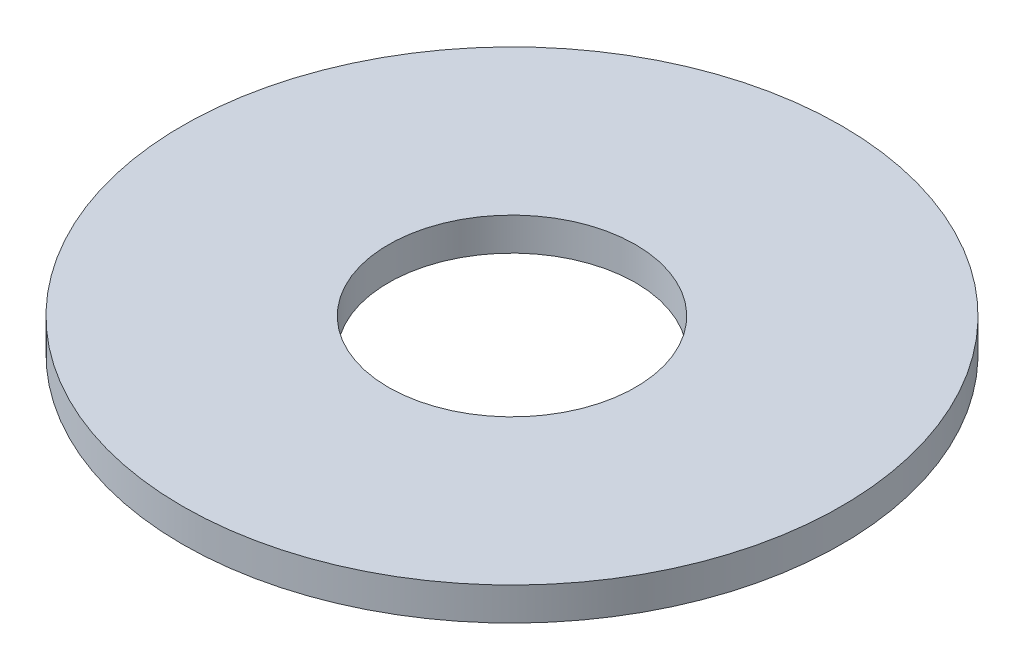
ISO-10303-21;
HEADER;
FILE_DESCRIPTION(('STEP AP214'),'2;1');
FILE_NAME('part.step','',(''),(''),'','','');
FILE_SCHEMA(('AUTOMOTIVE_DESIGN { 1 0 10303 214 1 1 1 1 }'));
ENDSEC;
DATA;
#1=APPLICATION_CONTEXT('core data for automotive mechanical design processes');
#2=APPLICATION_PROTOCOL_DEFINITION('international standard','automotive_design',2000,#1);
#3=PRODUCT_CONTEXT('',#1,'mechanical');
#4=PRODUCT('Part','Part','',(#3));
#5=PRODUCT_RELATED_PRODUCT_CATEGORY('part','',(#4));
#6=PRODUCT_DEFINITION_FORMATION('','',#4);
#7=PRODUCT_DEFINITION_CONTEXT('part definition',#1,'design');
#8=PRODUCT_DEFINITION('design','',#6,#7);
#9=PRODUCT_DEFINITION_SHAPE('','',#8);
#10=(LENGTH_UNIT() NAMED_UNIT(*) SI_UNIT(.MILLI.,.METRE.));
#11=(NAMED_UNIT(*) PLANE_ANGLE_UNIT() SI_UNIT($,.RADIAN.));
#12=(NAMED_UNIT(*) SI_UNIT($,.STERADIAN.) SOLID_ANGLE_UNIT());
#13=UNCERTAINTY_MEASURE_WITH_UNIT(LENGTH_MEASURE(1.E-05),#10,'distance_accuracy_value','');
#14=(GEOMETRIC_REPRESENTATION_CONTEXT(3) GLOBAL_UNCERTAINTY_ASSIGNED_CONTEXT((#13)) GLOBAL_UNIT_ASSIGNED_CONTEXT((#10,
#11,#12)) REPRESENTATION_CONTEXT('',''));
#15=CARTESIAN_POINT('',(0.,0.,0.));
#16=DIRECTION('',(0.,0.,1.));
#17=DIRECTION('',(1.,0.,0.));
#18=AXIS2_PLACEMENT_3D('',#15,#16,#17);
#19=CARTESIAN_POINT('',(0.,4.,0.));
#20=DIRECTION('',(0.,-1.,0.));
#21=DIRECTION('',(0.,0.,-1.));
#22=AXIS2_PLACEMENT_3D('',#19,#20,#21);
#23=CYLINDRICAL_SURFACE('',#22,40.);
#24=CARTESIAN_POINT('',(0.,4.,0.));
#25=DIRECTION('',(0.,1.,0.));
#26=DIRECTION('',(0.,0.,1.));
#27=AXIS2_PLACEMENT_3D('',#24,#25,#26);
#28=CIRCLE('',#27,40.);
#29=CARTESIAN_POINT('',(0.,4.,40.));
#30=VERTEX_POINT('',#29);
#31=EDGE_CURVE('E10',#30,#30,#28,.T.);
#32=ORIENTED_EDGE('',*,*,#31,.F.);
#33=EDGE_LOOP('',(#32));
#34=FACE_BOUND('',#33,.T.);
#35=CARTESIAN_POINT('',(0.,0.,0.));
#36=DIRECTION('',(0.,1.,0.));
#37=DIRECTION('',(0.,0.,1.));
#38=AXIS2_PLACEMENT_3D('',#35,#36,#37);
#39=CIRCLE('',#38,40.);
#40=CARTESIAN_POINT('',(0.,0.,40.));
#41=VERTEX_POINT('',#40);
#42=EDGE_CURVE('E37',#41,#41,#39,.T.);
#43=ORIENTED_EDGE('',*,*,#42,.T.);
#44=EDGE_LOOP('',(#43));
#45=FACE_BOUND('',#44,.T.);
#46=ADVANCED_FACE('F40',(#34,#45),#23,.T.);
#47=CARTESIAN_POINT('',(0.,4.,0.));
#48=DIRECTION('',(0.,1.,0.));
#49=DIRECTION('',(0.,0.,1.));
#50=AXIS2_PLACEMENT_3D('',#47,#48,#49);
#51=PLANE('',#50);
#52=CARTESIAN_POINT('',(0.,4.,0.));
#53=DIRECTION('',(0.,1.,0.));
#54=DIRECTION('',(0.,0.,1.));
#55=AXIS2_PLACEMENT_3D('',#52,#53,#54);
#56=CIRCLE('',#55,15.);
#57=CARTESIAN_POINT('',(0.,4.,15.));
#58=VERTEX_POINT('',#57);
#59=EDGE_CURVE('E50',#58,#58,#56,.T.);
#60=ORIENTED_EDGE('',*,*,#59,.F.);
#61=EDGE_LOOP('',(#60));
#62=FACE_BOUND('',#61,.T.);
#63=ORIENTED_EDGE('',*,*,#31,.T.);
#64=EDGE_LOOP('',(#63));
#65=FACE_BOUND('',#64,.T.);
#66=ADVANCED_FACE('F59',(#62,#65),#51,.T.);
#67=CARTESIAN_POINT('',(0.,0.,0.));
#68=DIRECTION('',(0.,1.,0.));
#69=DIRECTION('',(0.,0.,1.));
#70=AXIS2_PLACEMENT_3D('',#67,#68,#69);
#71=PLANE('',#70);
#72=CARTESIAN_POINT('',(0.,0.,0.));
#73=DIRECTION('',(0.,1.,0.));
#74=DIRECTION('',(0.,0.,1.));
#75=AXIS2_PLACEMENT_3D('',#72,#73,#74);
#76=CIRCLE('',#75,15.);
#77=CARTESIAN_POINT('',(0.,0.,15.));
#78=VERTEX_POINT('',#77);
#79=EDGE_CURVE('E47',#78,#78,#76,.T.);
#80=ORIENTED_EDGE('',*,*,#79,.T.);
#81=EDGE_LOOP('',(#80));
#82=FACE_BOUND('',#81,.T.);
#83=ORIENTED_EDGE('',*,*,#42,.F.);
#84=EDGE_LOOP('',(#83));
#85=FACE_BOUND('',#84,.T.);
#86=ADVANCED_FACE('F58',(#82,#85),#71,.F.);
#87=CARTESIAN_POINT('',(0.,4.,0.));
#88=DIRECTION('',(0.,-1.,0.));
#89=DIRECTION('',(0.,0.,-1.));
#90=AXIS2_PLACEMENT_3D('',#87,#88,#89);
#91=CYLINDRICAL_SURFACE('',#90,15.);
#92=ORIENTED_EDGE('',*,*,#59,.T.);
#93=EDGE_LOOP('',(#92));
#94=FACE_BOUND('',#93,.T.);
#95=ORIENTED_EDGE('',*,*,#79,.F.);
#96=EDGE_LOOP('',(#95));
#97=FACE_BOUND('',#96,.T.);
#98=ADVANCED_FACE('F54',(#94,#97),#91,.F.);
#99=CLOSED_SHELL('',(#46,#66,#86,#98));
#100=MANIFOLD_SOLID_BREP('B2',#99);
#101=ADVANCED_BREP_SHAPE_REPRESENTATION('',(#18,#100),#14);
#102=SHAPE_DEFINITION_REPRESENTATION(#9,#101);
ENDSEC;
END-ISO-10303-21;
